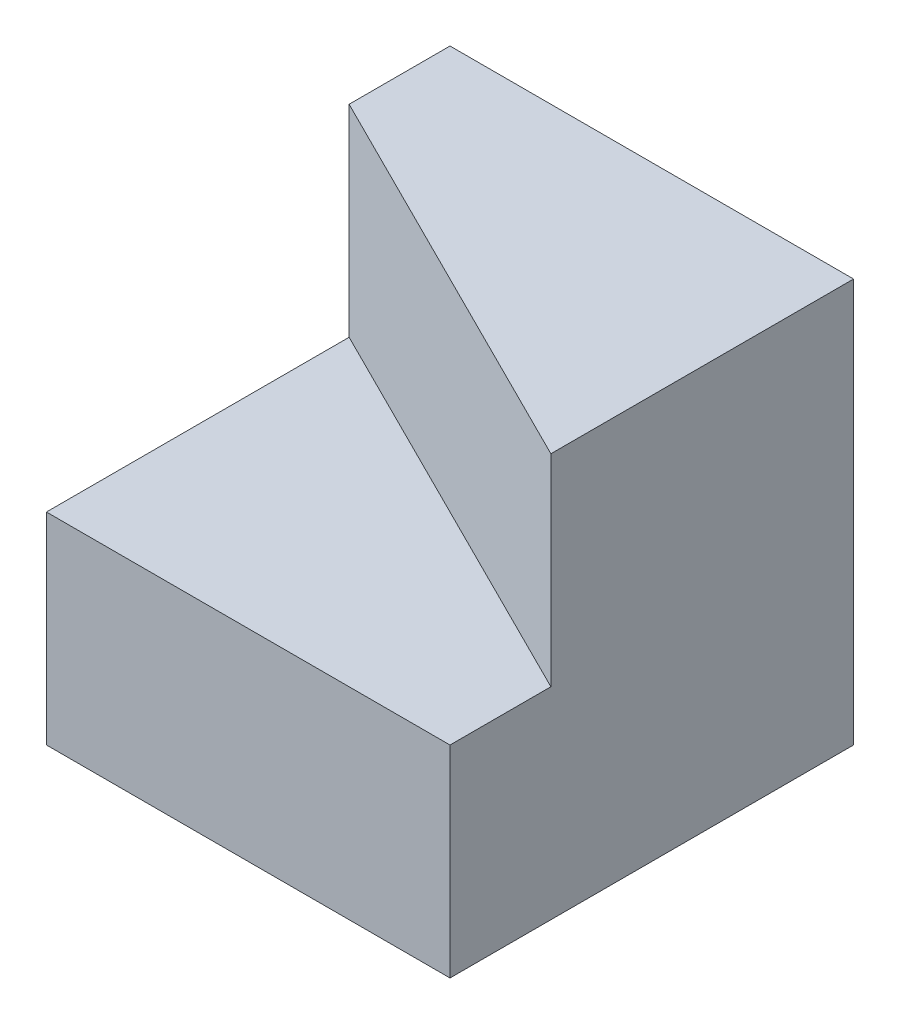
ISO-10303-21;
HEADER;
FILE_DESCRIPTION(('STEP AP214'),'2;1');
FILE_NAME('part.step','',(''),(''),'','','');
FILE_SCHEMA(('AUTOMOTIVE_DESIGN { 1 0 10303 214 1 1 1 1 }'));
ENDSEC;
DATA;
#1=APPLICATION_CONTEXT('core data for automotive mechanical design processes');
#2=APPLICATION_PROTOCOL_DEFINITION('international standard','automotive_design',2000,#1);
#3=PRODUCT_CONTEXT('',#1,'mechanical');
#4=PRODUCT('Part','Part','',(#3));
#5=PRODUCT_RELATED_PRODUCT_CATEGORY('part','',(#4));
#6=PRODUCT_DEFINITION_FORMATION('','',#4);
#7=PRODUCT_DEFINITION_CONTEXT('part definition',#1,'design');
#8=PRODUCT_DEFINITION('design','',#6,#7);
#9=PRODUCT_DEFINITION_SHAPE('','',#8);
#10=(LENGTH_UNIT() NAMED_UNIT(*) SI_UNIT(.MILLI.,.METRE.));
#11=(NAMED_UNIT(*) PLANE_ANGLE_UNIT() SI_UNIT($,.RADIAN.));
#12=(NAMED_UNIT(*) SI_UNIT($,.STERADIAN.) SOLID_ANGLE_UNIT());
#13=UNCERTAINTY_MEASURE_WITH_UNIT(LENGTH_MEASURE(1.E-05),#10,'distance_accuracy_value','');
#14=(GEOMETRIC_REPRESENTATION_CONTEXT(3) GLOBAL_UNCERTAINTY_ASSIGNED_CONTEXT((#13)) GLOBAL_UNIT_ASSIGNED_CONTEXT((#10,
#11,#12)) REPRESENTATION_CONTEXT('',''));
#15=CARTESIAN_POINT('',(0.,0.,0.));
#16=DIRECTION('',(0.,0.,1.));
#17=DIRECTION('',(1.,0.,0.));
#18=AXIS2_PLACEMENT_3D('',#15,#16,#17);
#19=CARTESIAN_POINT('',(0.,0.,40.));
#20=DIRECTION('',(0.,0.,-1.));
#21=DIRECTION('',(-1.,0.,0.));
#22=AXIS2_PLACEMENT_3D('',#19,#20,#21);
#23=PLANE('',#22);
#24=DIRECTION('',(1.,0.,0.));
#25=VECTOR('',#24,1.);
#26=CARTESIAN_POINT('',(40.,20.,40.));
#27=LINE('',#26,#25);
#28=CARTESIAN_POINT('',(0.,20.,40.));
#29=VERTEX_POINT('',#28);
#30=CARTESIAN_POINT('',(40.,20.,40.));
#31=VERTEX_POINT('',#30);
#32=EDGE_CURVE('E130',#29,#31,#27,.T.);
#33=ORIENTED_EDGE('',*,*,#32,.F.);
#34=DIRECTION('',(0.,-1.,0.));
#35=VECTOR('',#34,1.);
#36=CARTESIAN_POINT('',(0.,0.,40.));
#37=LINE('',#36,#35);
#38=CARTESIAN_POINT('',(0.,0.,40.));
#39=VERTEX_POINT('',#38);
#40=EDGE_CURVE('E97',#29,#39,#37,.T.);
#41=ORIENTED_EDGE('',*,*,#40,.T.);
#42=DIRECTION('',(1.,0.,0.));
#43=VECTOR('',#42,1.);
#44=CARTESIAN_POINT('',(0.,0.,40.));
#45=LINE('',#44,#43);
#46=CARTESIAN_POINT('',(40.,0.,40.));
#47=VERTEX_POINT('',#46);
#48=EDGE_CURVE('E57',#39,#47,#45,.T.);
#49=ORIENTED_EDGE('',*,*,#48,.T.);
#50=DIRECTION('',(0.,1.,0.));
#51=VECTOR('',#50,1.);
#52=CARTESIAN_POINT('',(40.,0.,40.));
#53=LINE('',#52,#51);
#54=EDGE_CURVE('E88',#47,#31,#53,.T.);
#55=ORIENTED_EDGE('',*,*,#54,.T.);
#56=EDGE_LOOP('',(#33,#41,#49,#55));
#57=FACE_BOUND('',#56,.T.);
#58=ADVANCED_FACE('F33',(#57),#23,.F.);
#59=CARTESIAN_POINT('',(0.,0.,40.));
#60=DIRECTION('',(1.,0.,0.));
#61=DIRECTION('',(0.,0.,-1.));
#62=AXIS2_PLACEMENT_3D('',#59,#60,#61);
#63=PLANE('',#62);
#64=DIRECTION('',(0.,0.,1.));
#65=VECTOR('',#64,1.);
#66=CARTESIAN_POINT('',(0.,20.,40.));
#67=LINE('',#66,#65);
#68=CARTESIAN_POINT('',(0.,20.,10.));
#69=VERTEX_POINT('',#68);
#70=EDGE_CURVE('E48',#69,#29,#67,.T.);
#71=ORIENTED_EDGE('',*,*,#70,.F.);
#72=DIRECTION('',(0.,1.,0.));
#73=VECTOR('',#72,1.);
#74=CARTESIAN_POINT('',(0.,20.,10.));
#75=LINE('',#74,#73);
#76=CARTESIAN_POINT('',(0.,40.,10.));
#77=VERTEX_POINT('',#76);
#78=EDGE_CURVE('E84',#69,#77,#75,.T.);
#79=ORIENTED_EDGE('',*,*,#78,.T.);
#80=DIRECTION('',(0.,0.,-1.));
#81=VECTOR('',#80,1.);
#82=CARTESIAN_POINT('',(0.,40.,40.));
#83=LINE('',#82,#81);
#84=CARTESIAN_POINT('',(0.,40.,0.));
#85=VERTEX_POINT('',#84);
#86=EDGE_CURVE('E77',#77,#85,#83,.T.);
#87=ORIENTED_EDGE('',*,*,#86,.T.);
#88=DIRECTION('',(0.,-1.,0.));
#89=VECTOR('',#88,1.);
#90=CARTESIAN_POINT('',(0.,0.,0.));
#91=LINE('',#90,#89);
#92=CARTESIAN_POINT('',(0.,0.,0.));
#93=VERTEX_POINT('',#92);
#94=EDGE_CURVE('E81',#85,#93,#91,.T.);
#95=ORIENTED_EDGE('',*,*,#94,.T.);
#96=DIRECTION('',(0.,0.,-1.));
#97=VECTOR('',#96,1.);
#98=CARTESIAN_POINT('',(0.,0.,40.));
#99=LINE('',#98,#97);
#100=EDGE_CURVE('E11',#39,#93,#99,.T.);
#101=ORIENTED_EDGE('',*,*,#100,.F.);
#102=ORIENTED_EDGE('',*,*,#40,.F.);
#103=EDGE_LOOP('',(#71,#79,#87,#95,#101,#102));
#104=FACE_BOUND('',#103,.T.);
#105=ADVANCED_FACE('F35',(#104),#63,.F.);
#106=CARTESIAN_POINT('',(0.,0.,40.));
#107=DIRECTION('',(0.,1.,0.));
#108=DIRECTION('',(0.,0.,1.));
#109=AXIS2_PLACEMENT_3D('',#106,#107,#108);
#110=PLANE('',#109);
#111=DIRECTION('',(1.,0.,0.));
#112=VECTOR('',#111,1.);
#113=CARTESIAN_POINT('',(0.,0.,0.));
#114=LINE('',#113,#112);
#115=CARTESIAN_POINT('',(40.,0.,0.));
#116=VERTEX_POINT('',#115);
#117=EDGE_CURVE('E101',#93,#116,#114,.T.);
#118=ORIENTED_EDGE('',*,*,#117,.T.);
#119=DIRECTION('',(0.,0.,-1.));
#120=VECTOR('',#119,1.);
#121=CARTESIAN_POINT('',(40.,0.,40.));
#122=LINE('',#121,#120);
#123=EDGE_CURVE('E41',#47,#116,#122,.T.);
#124=ORIENTED_EDGE('',*,*,#123,.F.);
#125=ORIENTED_EDGE('',*,*,#48,.F.);
#126=ORIENTED_EDGE('',*,*,#100,.T.);
#127=EDGE_LOOP('',(#118,#124,#125,#126));
#128=FACE_BOUND('',#127,.T.);
#129=ADVANCED_FACE('F116',(#128),#110,.F.);
#130=CARTESIAN_POINT('',(40.,0.,40.));
#131=DIRECTION('',(-1.,0.,0.));
#132=DIRECTION('',(0.,0.,1.));
#133=AXIS2_PLACEMENT_3D('',#130,#131,#132);
#134=PLANE('',#133);
#135=DIRECTION('',(0.,0.,-1.));
#136=VECTOR('',#135,1.);
#137=CARTESIAN_POINT('',(40.,40.,40.));
#138=LINE('',#137,#136);
#139=CARTESIAN_POINT('',(40.,40.,30.));
#140=VERTEX_POINT('',#139);
#141=CARTESIAN_POINT('',(40.,40.,0.));
#142=VERTEX_POINT('',#141);
#143=EDGE_CURVE('E87',#140,#142,#138,.T.);
#144=ORIENTED_EDGE('',*,*,#143,.F.);
#145=DIRECTION('',(0.,1.,0.));
#146=VECTOR('',#145,1.);
#147=CARTESIAN_POINT('',(40.,20.,30.));
#148=LINE('',#147,#146);
#149=CARTESIAN_POINT('',(40.,20.,30.));
#150=VERTEX_POINT('',#149);
#151=EDGE_CURVE('E104',#150,#140,#148,.T.);
#152=ORIENTED_EDGE('',*,*,#151,.F.);
#153=DIRECTION('',(0.,0.,-1.));
#154=VECTOR('',#153,1.);
#155=CARTESIAN_POINT('',(40.,20.,30.));
#156=LINE('',#155,#154);
#157=EDGE_CURVE('E127',#31,#150,#156,.T.);
#158=ORIENTED_EDGE('',*,*,#157,.F.);
#159=ORIENTED_EDGE('',*,*,#54,.F.);
#160=ORIENTED_EDGE('',*,*,#123,.T.);
#161=DIRECTION('',(0.,1.,0.));
#162=VECTOR('',#161,1.);
#163=CARTESIAN_POINT('',(40.,0.,0.));
#164=LINE('',#163,#162);
#165=EDGE_CURVE('E98',#116,#142,#164,.T.);
#166=ORIENTED_EDGE('',*,*,#165,.T.);
#167=EDGE_LOOP('',(#144,#152,#158,#159,#160,#166));
#168=FACE_BOUND('',#167,.T.);
#169=ADVANCED_FACE('F113',(#168),#134,.F.);
#170=CARTESIAN_POINT('',(0.,40.,40.));
#171=DIRECTION('',(0.,-1.,0.));
#172=DIRECTION('',(0.,0.,-1.));
#173=AXIS2_PLACEMENT_3D('',#170,#171,#172);
#174=PLANE('',#173);
#175=ORIENTED_EDGE('',*,*,#86,.F.);
#176=DIRECTION('',(-0.894427190999916,0.,-0.447213595499958));
#177=VECTOR('',#176,1.);
#178=CARTESIAN_POINT('',(0.,40.,10.));
#179=LINE('',#178,#177);
#180=EDGE_CURVE('E123',#140,#77,#179,.T.);
#181=ORIENTED_EDGE('',*,*,#180,.F.);
#182=ORIENTED_EDGE('',*,*,#143,.T.);
#183=DIRECTION('',(-1.,0.,0.));
#184=VECTOR('',#183,1.);
#185=CARTESIAN_POINT('',(0.,40.,0.));
#186=LINE('',#185,#184);
#187=EDGE_CURVE('E91',#142,#85,#186,.T.);
#188=ORIENTED_EDGE('',*,*,#187,.T.);
#189=EDGE_LOOP('',(#175,#181,#182,#188));
#190=FACE_BOUND('',#189,.T.);
#191=ADVANCED_FACE('F92',(#190),#174,.F.);
#192=CARTESIAN_POINT('',(0.,0.,0.));
#193=DIRECTION('',(0.,0.,-1.));
#194=DIRECTION('',(-1.,0.,0.));
#195=AXIS2_PLACEMENT_3D('',#192,#193,#194);
#196=PLANE('',#195);
#197=ORIENTED_EDGE('',*,*,#94,.F.);
#198=ORIENTED_EDGE('',*,*,#187,.F.);
#199=ORIENTED_EDGE('',*,*,#165,.F.);
#200=ORIENTED_EDGE('',*,*,#117,.F.);
#201=EDGE_LOOP('',(#197,#198,#199,#200));
#202=FACE_BOUND('',#201,.T.);
#203=ADVANCED_FACE('F100',(#202),#196,.T.);
#204=CARTESIAN_POINT('',(0.,20.,10.));
#205=DIRECTION('',(0.447213595499958,0.,-0.894427190999916));
#206=DIRECTION('',(-0.894427190999916,0.,-0.447213595499958));
#207=AXIS2_PLACEMENT_3D('',#204,#205,#206);
#208=PLANE('',#207);
#209=ORIENTED_EDGE('',*,*,#180,.T.);
#210=ORIENTED_EDGE('',*,*,#78,.F.);
#211=DIRECTION('',(-0.894427190999916,0.,-0.447213595499958));
#212=VECTOR('',#211,1.);
#213=CARTESIAN_POINT('',(0.,20.,10.));
#214=LINE('',#213,#212);
#215=EDGE_CURVE('E121',#150,#69,#214,.T.);
#216=ORIENTED_EDGE('',*,*,#215,.F.);
#217=ORIENTED_EDGE('',*,*,#151,.T.);
#218=EDGE_LOOP('',(#209,#210,#216,#217));
#219=FACE_BOUND('',#218,.T.);
#220=ADVANCED_FACE('F145',(#219),#208,.F.);
#221=CARTESIAN_POINT('',(0.,20.,0.));
#222=DIRECTION('',(0.,1.,0.));
#223=DIRECTION('',(0.,0.,1.));
#224=AXIS2_PLACEMENT_3D('',#221,#222,#223);
#225=PLANE('',#224);
#226=ORIENTED_EDGE('',*,*,#70,.T.);
#227=ORIENTED_EDGE('',*,*,#32,.T.);
#228=ORIENTED_EDGE('',*,*,#157,.T.);
#229=ORIENTED_EDGE('',*,*,#215,.T.);
#230=EDGE_LOOP('',(#226,#227,#228,#229));
#231=FACE_BOUND('',#230,.T.);
#232=ADVANCED_FACE('F133',(#231),#225,.T.);
#233=CLOSED_SHELL('',(#58,#105,#129,#169,#191,#203,#220,#232));
#234=MANIFOLD_SOLID_BREP('B2',#233);
#235=ADVANCED_BREP_SHAPE_REPRESENTATION('',(#18,#234),#14);
#236=SHAPE_DEFINITION_REPRESENTATION(#9,#235);
ENDSEC;
END-ISO-10303-21;
